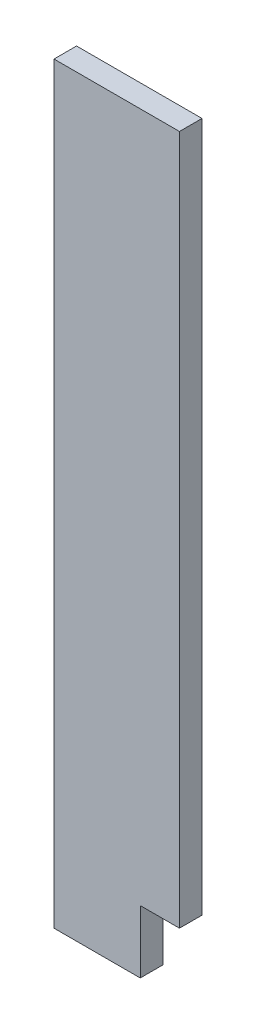
ISO-10303-21;
HEADER;
FILE_DESCRIPTION(('STEP AP214'),'2;1');
FILE_NAME('part.step','',(''),(''),'','','');
FILE_SCHEMA(('AUTOMOTIVE_DESIGN { 1 0 10303 214 1 1 1 1 }'));
ENDSEC;
DATA;
#1=APPLICATION_CONTEXT('core data for automotive mechanical design processes');
#2=APPLICATION_PROTOCOL_DEFINITION('international standard','automotive_design',2000,#1);
#3=PRODUCT_CONTEXT('',#1,'mechanical');
#4=PRODUCT('Part','Part','',(#3));
#5=PRODUCT_RELATED_PRODUCT_CATEGORY('part','',(#4));
#6=PRODUCT_DEFINITION_FORMATION('','',#4);
#7=PRODUCT_DEFINITION_CONTEXT('part definition',#1,'design');
#8=PRODUCT_DEFINITION('design','',#6,#7);
#9=PRODUCT_DEFINITION_SHAPE('','',#8);
#10=(LENGTH_UNIT() NAMED_UNIT(*) SI_UNIT(.MILLI.,.METRE.));
#11=(NAMED_UNIT(*) PLANE_ANGLE_UNIT() SI_UNIT($,.RADIAN.));
#12=(NAMED_UNIT(*) SI_UNIT($,.STERADIAN.) SOLID_ANGLE_UNIT());
#13=UNCERTAINTY_MEASURE_WITH_UNIT(LENGTH_MEASURE(1.E-05),#10,'distance_accuracy_value','');
#14=(GEOMETRIC_REPRESENTATION_CONTEXT(3) GLOBAL_UNCERTAINTY_ASSIGNED_CONTEXT((#13)) GLOBAL_UNIT_ASSIGNED_CONTEXT((#10,
#11,#12)) REPRESENTATION_CONTEXT('',''));
#15=CARTESIAN_POINT('',(0.,0.,0.));
#16=DIRECTION('',(0.,0.,1.));
#17=DIRECTION('',(1.,0.,0.));
#18=AXIS2_PLACEMENT_3D('',#15,#16,#17);
#19=CARTESIAN_POINT('',(-52.3819462923184,110.718900111933,18.25625));
#20=DIRECTION('',(1.,0.,0.));
#21=DIRECTION('',(0.,1.,0.));
#22=AXIS2_PLACEMENT_3D('',#19,#20,#21);
#23=PLANE('',#22);
#24=DIRECTION('',(0.,-1.,0.));
#25=VECTOR('',#24,1.);
#26=CARTESIAN_POINT('',(-52.3819462923184,110.718900111933,0.));
#27=LINE('',#26,#25);
#28=CARTESIAN_POINT('',(-52.3819462923184,110.718900111933,0.));
#29=VERTEX_POINT('',#28);
#30=CARTESIAN_POINT('',(-52.3819462923183,-498.881099888067,0.));
#31=VERTEX_POINT('',#30);
#32=EDGE_CURVE('E118',#29,#31,#27,.T.);
#33=ORIENTED_EDGE('',*,*,#32,.T.);
#34=DIRECTION('',(0.,0.,-1.));
#35=VECTOR('',#34,1.);
#36=CARTESIAN_POINT('',(-52.3819462923183,-498.881099888067,18.25625));
#37=LINE('',#36,#35);
#38=CARTESIAN_POINT('',(-52.3819462923183,-498.881099888067,18.25625));
#39=VERTEX_POINT('',#38);
#40=EDGE_CURVE('E11',#39,#31,#37,.T.);
#41=ORIENTED_EDGE('',*,*,#40,.F.);
#42=DIRECTION('',(0.,-1.,0.));
#43=VECTOR('',#42,1.);
#44=CARTESIAN_POINT('',(-52.3819462923184,110.718900111933,18.25625));
#45=LINE('',#44,#43);
#46=CARTESIAN_POINT('',(-52.3819462923184,110.718900111933,18.25625));
#47=VERTEX_POINT('',#46);
#48=EDGE_CURVE('E115',#47,#39,#45,.T.);
#49=ORIENTED_EDGE('',*,*,#48,.F.);
#50=DIRECTION('',(0.,0.,-1.));
#51=VECTOR('',#50,1.);
#52=CARTESIAN_POINT('',(-52.3819462923184,110.718900111933,18.25625));
#53=LINE('',#52,#51);
#54=EDGE_CURVE('E122',#47,#29,#53,.T.);
#55=ORIENTED_EDGE('',*,*,#54,.T.);
#56=EDGE_LOOP('',(#33,#41,#49,#55));
#57=FACE_BOUND('',#56,.T.);
#58=ADVANCED_FACE('F32',(#57),#23,.F.);
#59=CARTESIAN_POINT('',(-52.3819462923183,-498.881099888067,18.25625));
#60=DIRECTION('',(0.,1.,0.));
#61=DIRECTION('',(0.,0.,1.));
#62=AXIS2_PLACEMENT_3D('',#59,#60,#61);
#63=PLANE('',#62);
#64=DIRECTION('',(1.,0.,0.));
#65=VECTOR('',#64,1.);
#66=CARTESIAN_POINT('',(-52.3819462923183,-498.881099888067,0.));
#67=LINE('',#66,#65);
#68=CARTESIAN_POINT('',(17.4680537076817,-498.881099888067,0.));
#69=VERTEX_POINT('',#68);
#70=EDGE_CURVE('E113',#31,#69,#67,.T.);
#71=ORIENTED_EDGE('',*,*,#70,.T.);
#72=DIRECTION('',(0.,0.,1.));
#73=VECTOR('',#72,1.);
#74=CARTESIAN_POINT('',(17.4680537076817,-498.881099888067,0.));
#75=LINE('',#74,#73);
#76=CARTESIAN_POINT('',(17.4680537076817,-498.881099888067,18.25625));
#77=VERTEX_POINT('',#76);
#78=EDGE_CURVE('E129',#69,#77,#75,.T.);
#79=ORIENTED_EDGE('',*,*,#78,.T.);
#80=DIRECTION('',(1.,0.,0.));
#81=VECTOR('',#80,1.);
#82=CARTESIAN_POINT('',(-52.3819462923183,-498.881099888067,18.25625));
#83=LINE('',#82,#81);
#84=EDGE_CURVE('E78',#39,#77,#83,.T.);
#85=ORIENTED_EDGE('',*,*,#84,.F.);
#86=ORIENTED_EDGE('',*,*,#40,.T.);
#87=EDGE_LOOP('',(#71,#79,#85,#86));
#88=FACE_BOUND('',#87,.T.);
#89=ADVANCED_FACE('F139',(#88),#63,.F.);
#90=CARTESIAN_POINT('',(49.2180537076816,110.718900111933,18.25625));
#91=DIRECTION('',(-1.,0.,0.));
#92=DIRECTION('',(0.,-1.,0.));
#93=AXIS2_PLACEMENT_3D('',#90,#91,#92);
#94=PLANE('',#93);
#95=DIRECTION('',(0.,1.,0.));
#96=VECTOR('',#95,1.);
#97=CARTESIAN_POINT('',(49.2180537076816,110.718900111933,18.25625));
#98=LINE('',#97,#96);
#99=CARTESIAN_POINT('',(49.2180537076817,-448.081099888067,18.25625));
#100=VERTEX_POINT('',#99);
#101=CARTESIAN_POINT('',(49.2180537076816,110.718900111933,18.25625));
#102=VERTEX_POINT('',#101);
#103=EDGE_CURVE('E109',#100,#102,#98,.T.);
#104=ORIENTED_EDGE('',*,*,#103,.F.);
#105=DIRECTION('',(0.,0.,1.));
#106=VECTOR('',#105,1.);
#107=CARTESIAN_POINT('',(49.2180537076817,-448.081099888067,0.));
#108=LINE('',#107,#106);
#109=CARTESIAN_POINT('',(49.2180537076817,-448.081099888067,0.));
#110=VERTEX_POINT('',#109);
#111=EDGE_CURVE('E97',#110,#100,#108,.T.);
#112=ORIENTED_EDGE('',*,*,#111,.F.);
#113=DIRECTION('',(0.,1.,0.));
#114=VECTOR('',#113,1.);
#115=CARTESIAN_POINT('',(49.2180537076816,110.718900111933,0.));
#116=LINE('',#115,#114);
#117=CARTESIAN_POINT('',(49.2180537076816,110.718900111933,0.));
#118=VERTEX_POINT('',#117);
#119=EDGE_CURVE('E108',#110,#118,#116,.T.);
#120=ORIENTED_EDGE('',*,*,#119,.T.);
#121=DIRECTION('',(0.,0.,-1.));
#122=VECTOR('',#121,1.);
#123=CARTESIAN_POINT('',(49.2180537076816,110.718900111933,18.25625));
#124=LINE('',#123,#122);
#125=EDGE_CURVE('E39',#102,#118,#124,.T.);
#126=ORIENTED_EDGE('',*,*,#125,.F.);
#127=EDGE_LOOP('',(#104,#112,#120,#126));
#128=FACE_BOUND('',#127,.T.);
#129=ADVANCED_FACE('F106',(#128),#94,.F.);
#130=CARTESIAN_POINT('',(-52.3819462923184,110.718900111933,18.25625));
#131=DIRECTION('',(0.,-1.,0.));
#132=DIRECTION('',(0.,0.,-1.));
#133=AXIS2_PLACEMENT_3D('',#130,#131,#132);
#134=PLANE('',#133);
#135=DIRECTION('',(-1.,0.,0.));
#136=VECTOR('',#135,1.);
#137=CARTESIAN_POINT('',(-52.3819462923184,110.718900111933,0.));
#138=LINE('',#137,#136);
#139=EDGE_CURVE('E72',#118,#29,#138,.T.);
#140=ORIENTED_EDGE('',*,*,#139,.T.);
#141=ORIENTED_EDGE('',*,*,#54,.F.);
#142=DIRECTION('',(-1.,0.,0.));
#143=VECTOR('',#142,1.);
#144=CARTESIAN_POINT('',(-52.3819462923184,110.718900111933,18.25625));
#145=LINE('',#144,#143);
#146=EDGE_CURVE('E55',#102,#47,#145,.T.);
#147=ORIENTED_EDGE('',*,*,#146,.F.);
#148=ORIENTED_EDGE('',*,*,#125,.T.);
#149=EDGE_LOOP('',(#140,#141,#147,#148));
#150=FACE_BOUND('',#149,.T.);
#151=ADVANCED_FACE('F123',(#150),#134,.F.);
#152=CARTESIAN_POINT('',(0.,0.,18.25625));
#153=DIRECTION('',(0.,0.,1.));
#154=DIRECTION('',(1.,0.,0.));
#155=AXIS2_PLACEMENT_3D('',#152,#153,#154);
#156=PLANE('',#155);
#157=DIRECTION('',(0.,-1.,0.));
#158=VECTOR('',#157,1.);
#159=CARTESIAN_POINT('',(17.4680537076817,-498.881099888067,18.25625));
#160=LINE('',#159,#158);
#161=CARTESIAN_POINT('',(17.4680537076817,-448.081099888067,18.25625));
#162=VERTEX_POINT('',#161);
#163=EDGE_CURVE('E102',#162,#77,#160,.T.);
#164=ORIENTED_EDGE('',*,*,#163,.F.);
#165=DIRECTION('',(-1.,0.,0.));
#166=VECTOR('',#165,1.);
#167=CARTESIAN_POINT('',(49.2180537076817,-448.081099888067,18.25625));
#168=LINE('',#167,#166);
#169=EDGE_CURVE('E141',#100,#162,#168,.T.);
#170=ORIENTED_EDGE('',*,*,#169,.F.);
#171=ORIENTED_EDGE('',*,*,#103,.T.);
#172=ORIENTED_EDGE('',*,*,#146,.T.);
#173=ORIENTED_EDGE('',*,*,#48,.T.);
#174=ORIENTED_EDGE('',*,*,#84,.T.);
#175=EDGE_LOOP('',(#164,#170,#171,#172,#173,#174));
#176=FACE_BOUND('',#175,.T.);
#177=ADVANCED_FACE('F138',(#176),#156,.T.);
#178=CARTESIAN_POINT('',(0.,0.,0.));
#179=DIRECTION('',(0.,0.,1.));
#180=DIRECTION('',(1.,0.,0.));
#181=AXIS2_PLACEMENT_3D('',#178,#179,#180);
#182=PLANE('',#181);
#183=DIRECTION('',(-1.,0.,0.));
#184=VECTOR('',#183,1.);
#185=CARTESIAN_POINT('',(49.2180537076817,-448.081099888067,0.));
#186=LINE('',#185,#184);
#187=CARTESIAN_POINT('',(17.4680537076817,-448.081099888067,0.));
#188=VERTEX_POINT('',#187);
#189=EDGE_CURVE('E93',#110,#188,#186,.T.);
#190=ORIENTED_EDGE('',*,*,#189,.T.);
#191=DIRECTION('',(0.,-1.,0.));
#192=VECTOR('',#191,1.);
#193=CARTESIAN_POINT('',(17.4680537076817,-498.881099888067,0.));
#194=LINE('',#193,#192);
#195=EDGE_CURVE('E46',#188,#69,#194,.T.);
#196=ORIENTED_EDGE('',*,*,#195,.T.);
#197=ORIENTED_EDGE('',*,*,#70,.F.);
#198=ORIENTED_EDGE('',*,*,#32,.F.);
#199=ORIENTED_EDGE('',*,*,#139,.F.);
#200=ORIENTED_EDGE('',*,*,#119,.F.);
#201=EDGE_LOOP('',(#190,#196,#197,#198,#199,#200));
#202=FACE_BOUND('',#201,.T.);
#203=ADVANCED_FACE('F111',(#202),#182,.F.);
#204=CARTESIAN_POINT('',(17.4680537076817,-498.881099888067,0.));
#205=DIRECTION('',(-1.,0.,0.));
#206=DIRECTION('',(0.,0.,1.));
#207=AXIS2_PLACEMENT_3D('',#204,#205,#206);
#208=PLANE('',#207);
#209=ORIENTED_EDGE('',*,*,#163,.T.);
#210=ORIENTED_EDGE('',*,*,#78,.F.);
#211=ORIENTED_EDGE('',*,*,#195,.F.);
#212=DIRECTION('',(0.,0.,1.));
#213=VECTOR('',#212,1.);
#214=CARTESIAN_POINT('',(17.4680537076817,-448.081099888067,0.));
#215=LINE('',#214,#213);
#216=EDGE_CURVE('E99',#188,#162,#215,.T.);
#217=ORIENTED_EDGE('',*,*,#216,.T.);
#218=EDGE_LOOP('',(#209,#210,#211,#217));
#219=FACE_BOUND('',#218,.T.);
#220=ADVANCED_FACE('F142',(#219),#208,.F.);
#221=CARTESIAN_POINT('',(49.2180537076817,-448.081099888067,0.));
#222=DIRECTION('',(0.,1.,0.));
#223=DIRECTION('',(0.,0.,1.));
#224=AXIS2_PLACEMENT_3D('',#221,#222,#223);
#225=PLANE('',#224);
#226=ORIENTED_EDGE('',*,*,#169,.T.);
#227=ORIENTED_EDGE('',*,*,#216,.F.);
#228=ORIENTED_EDGE('',*,*,#189,.F.);
#229=ORIENTED_EDGE('',*,*,#111,.T.);
#230=EDGE_LOOP('',(#226,#227,#228,#229));
#231=FACE_BOUND('',#230,.T.);
#232=ADVANCED_FACE('F96',(#231),#225,.F.);
#233=CLOSED_SHELL('',(#58,#89,#129,#151,#177,#203,#220,#232));
#234=MANIFOLD_SOLID_BREP('B2',#233);
#235=ADVANCED_BREP_SHAPE_REPRESENTATION('',(#18,#234),#14);
#236=SHAPE_DEFINITION_REPRESENTATION(#9,#235);
ENDSEC;
END-ISO-10303-21;
